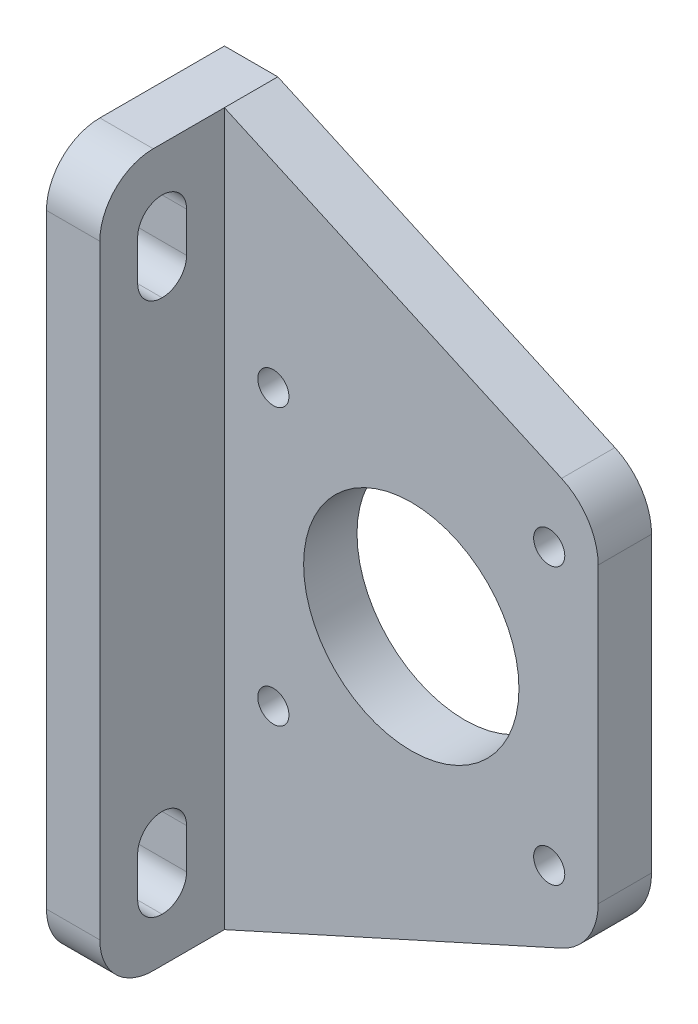
ISO-10303-21;
HEADER;
FILE_DESCRIPTION(('STEP AP214'),'2;1');
FILE_NAME('part.step','',(''),(''),'','','');
FILE_SCHEMA(('AUTOMOTIVE_DESIGN { 1 0 10303 214 1 1 1 1 }'));
ENDSEC;
DATA;
#1=APPLICATION_CONTEXT('core data for automotive mechanical design processes');
#2=APPLICATION_PROTOCOL_DEFINITION('international standard','automotive_design',2000,#1);
#3=PRODUCT_CONTEXT('',#1,'mechanical');
#4=PRODUCT('Part','Part','',(#3));
#5=PRODUCT_RELATED_PRODUCT_CATEGORY('part','',(#4));
#6=PRODUCT_DEFINITION_FORMATION('','',#4);
#7=PRODUCT_DEFINITION_CONTEXT('part definition',#1,'design');
#8=PRODUCT_DEFINITION('design','',#6,#7);
#9=PRODUCT_DEFINITION_SHAPE('','',#8);
#10=(LENGTH_UNIT() NAMED_UNIT(*) SI_UNIT(.MILLI.,.METRE.));
#11=(NAMED_UNIT(*) PLANE_ANGLE_UNIT() SI_UNIT($,.RADIAN.));
#12=(NAMED_UNIT(*) SI_UNIT($,.STERADIAN.) SOLID_ANGLE_UNIT());
#13=UNCERTAINTY_MEASURE_WITH_UNIT(LENGTH_MEASURE(1.E-05),#10,'distance_accuracy_value','');
#14=(GEOMETRIC_REPRESENTATION_CONTEXT(3) GLOBAL_UNCERTAINTY_ASSIGNED_CONTEXT((#13)) GLOBAL_UNIT_ASSIGNED_CONTEXT((#10,
#11,#12)) REPRESENTATION_CONTEXT('',''));
#15=CARTESIAN_POINT('',(0.,0.,0.));
#16=DIRECTION('',(0.,0.,1.));
#17=DIRECTION('',(1.,0.,0.));
#18=AXIS2_PLACEMENT_3D('',#15,#16,#17);
#19=CARTESIAN_POINT('',(15.5000000000009,-15.5,6.));
#20=DIRECTION('',(0.,0.,-1.));
#21=DIRECTION('',(-1.,0.,0.));
#22=AXIS2_PLACEMENT_3D('',#19,#20,#21);
#23=CYLINDRICAL_SURFACE('',#22,1.75);
#24=CARTESIAN_POINT('',(15.5000000000009,-15.5,6.));
#25=DIRECTION('',(0.,0.,1.));
#26=DIRECTION('',(1.,0.,0.));
#27=AXIS2_PLACEMENT_3D('',#24,#25,#26);
#28=CIRCLE('',#27,1.75);
#29=CARTESIAN_POINT('',(17.2500000000009,-15.5,6.));
#30=VERTEX_POINT('',#29);
#31=EDGE_CURVE('E415',#30,#30,#28,.T.);
#32=ORIENTED_EDGE('',*,*,#31,.T.);
#33=EDGE_LOOP('',(#32));
#34=FACE_BOUND('',#33,.T.);
#35=CARTESIAN_POINT('',(15.5000000000009,-15.5,3.5));
#36=DIRECTION('',(0.,0.,-1.));
#37=DIRECTION('',(-1.,0.,0.));
#38=AXIS2_PLACEMENT_3D('',#35,#36,#37);
#39=CIRCLE('',#38,1.75);
#40=CARTESIAN_POINT('',(13.7500000000009,-15.5,3.5));
#41=VERTEX_POINT('',#40);
#42=EDGE_CURVE('E247',#41,#41,#39,.T.);
#43=ORIENTED_EDGE('',*,*,#42,.T.);
#44=EDGE_LOOP('',(#43));
#45=FACE_BOUND('',#44,.T.);
#46=ADVANCED_FACE('F34',(#34,#45),#23,.F.);
#47=CARTESIAN_POINT('',(-15.4999999999991,-15.5000000000009,6.));
#48=DIRECTION('',(0.,0.,-1.));
#49=DIRECTION('',(-1.,0.,0.));
#50=AXIS2_PLACEMENT_3D('',#47,#48,#49);
#51=CYLINDRICAL_SURFACE('',#50,1.75);
#52=CARTESIAN_POINT('',(-15.4999999999991,-15.5000000000009,6.));
#53=DIRECTION('',(0.,0.,1.));
#54=DIRECTION('',(1.,0.,0.));
#55=AXIS2_PLACEMENT_3D('',#52,#53,#54);
#56=CIRCLE('',#55,1.75);
#57=CARTESIAN_POINT('',(-13.7499999999991,-15.5000000000009,6.));
#58=VERTEX_POINT('',#57);
#59=EDGE_CURVE('E412',#58,#58,#56,.T.);
#60=ORIENTED_EDGE('',*,*,#59,.T.);
#61=EDGE_LOOP('',(#60));
#62=FACE_BOUND('',#61,.T.);
#63=CARTESIAN_POINT('',(-15.4999999999991,-15.5000000000009,3.5));
#64=DIRECTION('',(0.,0.,-1.));
#65=DIRECTION('',(-1.,0.,0.));
#66=AXIS2_PLACEMENT_3D('',#63,#64,#65);
#67=CIRCLE('',#66,1.75);
#68=CARTESIAN_POINT('',(-17.2499999999991,-15.5000000000009,3.5));
#69=VERTEX_POINT('',#68);
#70=EDGE_CURVE('E243',#69,#69,#67,.T.);
#71=ORIENTED_EDGE('',*,*,#70,.T.);
#72=EDGE_LOOP('',(#71));
#73=FACE_BOUND('',#72,.T.);
#74=ADVANCED_FACE('F463',(#62,#73),#51,.F.);
#75=CARTESIAN_POINT('',(-15.5,15.4999999999991,6.));
#76=DIRECTION('',(0.,0.,-1.));
#77=DIRECTION('',(-1.,0.,0.));
#78=AXIS2_PLACEMENT_3D('',#75,#76,#77);
#79=CYLINDRICAL_SURFACE('',#78,1.75);
#80=CARTESIAN_POINT('',(-15.5,15.4999999999991,6.));
#81=DIRECTION('',(0.,0.,1.));
#82=DIRECTION('',(1.,0.,0.));
#83=AXIS2_PLACEMENT_3D('',#80,#81,#82);
#84=CIRCLE('',#83,1.75);
#85=CARTESIAN_POINT('',(-13.75,15.4999999999991,6.));
#86=VERTEX_POINT('',#85);
#87=EDGE_CURVE('E238',#86,#86,#84,.T.);
#88=ORIENTED_EDGE('',*,*,#87,.T.);
#89=EDGE_LOOP('',(#88));
#90=FACE_BOUND('',#89,.T.);
#91=CARTESIAN_POINT('',(-15.5,15.4999999999991,3.5));
#92=DIRECTION('',(0.,0.,-1.));
#93=DIRECTION('',(-1.,0.,0.));
#94=AXIS2_PLACEMENT_3D('',#91,#92,#93);
#95=CIRCLE('',#94,1.75);
#96=CARTESIAN_POINT('',(-17.25,15.4999999999991,3.5));
#97=VERTEX_POINT('',#96);
#98=EDGE_CURVE('E240',#97,#97,#95,.T.);
#99=ORIENTED_EDGE('',*,*,#98,.T.);
#100=EDGE_LOOP('',(#99));
#101=FACE_BOUND('',#100,.T.);
#102=ADVANCED_FACE('F469',(#90,#101),#79,.F.);
#103=CARTESIAN_POINT('',(15.5,15.5,6.));
#104=DIRECTION('',(0.,0.,-1.));
#105=DIRECTION('',(-1.,0.,0.));
#106=AXIS2_PLACEMENT_3D('',#103,#104,#105);
#107=CYLINDRICAL_SURFACE('',#106,1.75);
#108=CARTESIAN_POINT('',(15.5,15.5,6.));
#109=DIRECTION('',(0.,0.,1.));
#110=DIRECTION('',(1.,0.,0.));
#111=AXIS2_PLACEMENT_3D('',#108,#109,#110);
#112=CIRCLE('',#111,1.75);
#113=CARTESIAN_POINT('',(17.25,15.5,6.));
#114=VERTEX_POINT('',#113);
#115=EDGE_CURVE('E418',#114,#114,#112,.T.);
#116=ORIENTED_EDGE('',*,*,#115,.T.);
#117=EDGE_LOOP('',(#116));
#118=FACE_BOUND('',#117,.T.);
#119=CARTESIAN_POINT('',(15.5,15.5,3.5));
#120=DIRECTION('',(0.,0.,-1.));
#121=DIRECTION('',(-1.,0.,0.));
#122=AXIS2_PLACEMENT_3D('',#119,#120,#121);
#123=CIRCLE('',#122,1.75);
#124=CARTESIAN_POINT('',(13.75,15.5,3.5));
#125=VERTEX_POINT('',#124);
#126=EDGE_CURVE('E235',#125,#125,#123,.T.);
#127=ORIENTED_EDGE('',*,*,#126,.T.);
#128=EDGE_LOOP('',(#127));
#129=FACE_BOUND('',#128,.T.);
#130=ADVANCED_FACE('F475',(#118,#129),#107,.F.);
#131=CARTESIAN_POINT('',(0.,0.,6.));
#132=DIRECTION('',(0.,0.,1.));
#133=DIRECTION('',(1.,0.,0.));
#134=AXIS2_PLACEMENT_3D('',#131,#132,#133);
#135=PLANE('',#134);
#136=ORIENTED_EDGE('',*,*,#59,.F.);
#137=EDGE_LOOP('',(#136));
#138=FACE_BOUND('',#137,.T.);
#139=ORIENTED_EDGE('',*,*,#115,.F.);
#140=EDGE_LOOP('',(#139));
#141=FACE_BOUND('',#140,.T.);
#142=DIRECTION('',(0.,1.,0.));
#143=VECTOR('',#142,1.);
#144=CARTESIAN_POINT('',(21.,-21.,6.));
#145=LINE('',#144,#143);
#146=CARTESIAN_POINT('',(21.,-16.4837129522559,6.));
#147=VERTEX_POINT('',#146);
#148=CARTESIAN_POINT('',(21.,16.4837129522559,6.));
#149=VERTEX_POINT('',#148);
#150=EDGE_CURVE('E215',#147,#149,#145,.T.);
#151=ORIENTED_EDGE('',*,*,#150,.T.);
#152=CARTESIAN_POINT('',(14.,16.4837129522559,6.));
#153=DIRECTION('',(0.,0.,1.));
#154=DIRECTION('',(1.,0.,0.));
#155=AXIS2_PLACEMENT_3D('',#152,#153,#154);
#156=CIRCLE('',#155,7.);
#157=CARTESIAN_POINT('',(16.8851750889881,22.8614684121244,6.));
#158=VERTEX_POINT('',#157);
#159=EDGE_CURVE('E263',#149,#158,#156,.T.);
#160=ORIENTED_EDGE('',*,*,#159,.T.);
#161=DIRECTION('',(-0.911107922838356,0.412167869855447,0.));
#162=VECTOR('',#161,1.);
#163=CARTESIAN_POINT('',(-21.,40.,6.));
#164=LINE('',#163,#162);
#165=CARTESIAN_POINT('',(-21.,40.,6.));
#166=VERTEX_POINT('',#165);
#167=EDGE_CURVE('E226',#158,#166,#164,.T.);
#168=ORIENTED_EDGE('',*,*,#167,.T.);
#169=DIRECTION('',(0.,-1.,0.));
#170=VECTOR('',#169,1.);
#171=CARTESIAN_POINT('',(-21.,40.,6.));
#172=LINE('',#171,#170);
#173=CARTESIAN_POINT('',(-21.,-40.,6.));
#174=VERTEX_POINT('',#173);
#175=EDGE_CURVE('E428',#166,#174,#172,.T.);
#176=ORIENTED_EDGE('',*,*,#175,.T.);
#177=DIRECTION('',(0.911107922838356,0.412167869855447,0.));
#178=VECTOR('',#177,1.);
#179=CARTESIAN_POINT('',(-21.,-40.,6.));
#180=LINE('',#179,#178);
#181=CARTESIAN_POINT('',(16.8851750889881,-22.8614684121244,6.));
#182=VERTEX_POINT('',#181);
#183=EDGE_CURVE('E213',#174,#182,#180,.T.);
#184=ORIENTED_EDGE('',*,*,#183,.T.);
#185=CARTESIAN_POINT('',(14.,-16.4837129522559,6.));
#186=DIRECTION('',(0.,0.,1.));
#187=DIRECTION('',(1.,0.,0.));
#188=AXIS2_PLACEMENT_3D('',#185,#186,#187);
#189=CIRCLE('',#188,7.);
#190=EDGE_CURVE('E261',#182,#147,#189,.T.);
#191=ORIENTED_EDGE('',*,*,#190,.T.);
#192=EDGE_LOOP('',(#151,#160,#168,#176,#184,#191));
#193=FACE_BOUND('',#192,.T.);
#194=CARTESIAN_POINT('',(0.,0.,6.));
#195=DIRECTION('',(0.,0.,1.));
#196=DIRECTION('',(1.,0.,0.));
#197=AXIS2_PLACEMENT_3D('',#194,#195,#196);
#198=CIRCLE('',#197,12.1);
#199=CARTESIAN_POINT('',(12.1,0.,6.));
#200=VERTEX_POINT('',#199);
#201=EDGE_CURVE('E229',#200,#200,#198,.T.);
#202=ORIENTED_EDGE('',*,*,#201,.F.);
#203=EDGE_LOOP('',(#202));
#204=FACE_BOUND('',#203,.T.);
#205=ORIENTED_EDGE('',*,*,#31,.F.);
#206=EDGE_LOOP('',(#205));
#207=FACE_BOUND('',#206,.T.);
#208=ORIENTED_EDGE('',*,*,#87,.F.);
#209=EDGE_LOOP('',(#208));
#210=FACE_BOUND('',#209,.T.);
#211=ADVANCED_FACE('F434',(#138,#141,#193,#204,#207,#210),#135,.T.);
#212=CARTESIAN_POINT('',(0.,0.,0.));
#213=DIRECTION('',(0.,0.,1.));
#214=DIRECTION('',(1.,0.,0.));
#215=AXIS2_PLACEMENT_3D('',#212,#213,#214);
#216=PLANE('',#215);
#217=CARTESIAN_POINT('',(-15.5,15.5000000000009,0.));
#218=DIRECTION('',(0.,0.,-1.));
#219=DIRECTION('',(-1.,0.,0.));
#220=AXIS2_PLACEMENT_3D('',#217,#218,#219);
#221=CIRCLE('',#220,3.25);
#222=CARTESIAN_POINT('',(-18.75,15.5000000000009,0.));
#223=VERTEX_POINT('',#222);
#224=EDGE_CURVE('E392',#223,#223,#221,.T.);
#225=ORIENTED_EDGE('',*,*,#224,.F.);
#226=EDGE_LOOP('',(#225));
#227=FACE_BOUND('',#226,.T.);
#228=CARTESIAN_POINT('',(-15.5000000000009,-15.4999999999991,0.));
#229=DIRECTION('',(0.,0.,-1.));
#230=DIRECTION('',(-1.,0.,0.));
#231=AXIS2_PLACEMENT_3D('',#228,#229,#230);
#232=CIRCLE('',#231,3.25);
#233=CARTESIAN_POINT('',(-18.7500000000009,-15.4999999999991,0.));
#234=VERTEX_POINT('',#233);
#235=EDGE_CURVE('E398',#234,#234,#232,.T.);
#236=ORIENTED_EDGE('',*,*,#235,.F.);
#237=EDGE_LOOP('',(#236));
#238=FACE_BOUND('',#237,.T.);
#239=CARTESIAN_POINT('',(15.4999999999991,-15.5,0.));
#240=DIRECTION('',(0.,0.,-1.));
#241=DIRECTION('',(-1.,0.,0.));
#242=AXIS2_PLACEMENT_3D('',#239,#240,#241);
#243=CIRCLE('',#242,3.25);
#244=CARTESIAN_POINT('',(12.2499999999991,-15.5,0.));
#245=VERTEX_POINT('',#244);
#246=EDGE_CURVE('E386',#245,#245,#243,.T.);
#247=ORIENTED_EDGE('',*,*,#246,.F.);
#248=EDGE_LOOP('',(#247));
#249=FACE_BOUND('',#248,.T.);
#250=CARTESIAN_POINT('',(15.5,15.5,0.));
#251=DIRECTION('',(0.,0.,-1.));
#252=DIRECTION('',(-1.,0.,0.));
#253=AXIS2_PLACEMENT_3D('',#250,#251,#252);
#254=CIRCLE('',#253,3.25);
#255=CARTESIAN_POINT('',(12.25,15.5,0.));
#256=VERTEX_POINT('',#255);
#257=EDGE_CURVE('E250',#256,#256,#254,.T.);
#258=ORIENTED_EDGE('',*,*,#257,.F.);
#259=EDGE_LOOP('',(#258));
#260=FACE_BOUND('',#259,.T.);
#261=DIRECTION('',(-0.911107922838356,0.412167869855447,0.));
#262=VECTOR('',#261,1.);
#263=CARTESIAN_POINT('',(-21.,40.,0.));
#264=LINE('',#263,#262);
#265=CARTESIAN_POINT('',(16.8851750889881,22.8614684121244,0.));
#266=VERTEX_POINT('',#265);
#267=CARTESIAN_POINT('',(-21.,40.,0.));
#268=VERTEX_POINT('',#267);
#269=EDGE_CURVE('E223',#266,#268,#264,.T.);
#270=ORIENTED_EDGE('',*,*,#269,.F.);
#271=CARTESIAN_POINT('',(14.,16.4837129522559,0.));
#272=DIRECTION('',(0.,0.,1.));
#273=DIRECTION('',(1.,0.,0.));
#274=AXIS2_PLACEMENT_3D('',#271,#272,#273);
#275=CIRCLE('',#274,7.);
#276=CARTESIAN_POINT('',(21.,16.4837129522559,0.));
#277=VERTEX_POINT('',#276);
#278=EDGE_CURVE('E254',#266,#277,#275,.F.);
#279=ORIENTED_EDGE('',*,*,#278,.T.);
#280=DIRECTION('',(0.,1.,0.));
#281=VECTOR('',#280,1.);
#282=CARTESIAN_POINT('',(21.,-21.,0.));
#283=LINE('',#282,#281);
#284=CARTESIAN_POINT('',(21.,-16.4837129522559,0.));
#285=VERTEX_POINT('',#284);
#286=EDGE_CURVE('E222',#285,#277,#283,.T.);
#287=ORIENTED_EDGE('',*,*,#286,.F.);
#288=CARTESIAN_POINT('',(14.,-16.4837129522559,0.));
#289=DIRECTION('',(0.,0.,1.));
#290=DIRECTION('',(1.,0.,0.));
#291=AXIS2_PLACEMENT_3D('',#288,#289,#290);
#292=CIRCLE('',#291,7.);
#293=CARTESIAN_POINT('',(16.8851750889881,-22.8614684121244,0.));
#294=VERTEX_POINT('',#293);
#295=EDGE_CURVE('E221',#285,#294,#292,.F.);
#296=ORIENTED_EDGE('',*,*,#295,.T.);
#297=DIRECTION('',(0.911107922838356,0.412167869855447,0.));
#298=VECTOR('',#297,1.);
#299=CARTESIAN_POINT('',(-21.,-40.,0.));
#300=LINE('',#299,#298);
#301=CARTESIAN_POINT('',(-21.,-40.,0.));
#302=VERTEX_POINT('',#301);
#303=EDGE_CURVE('E210',#302,#294,#300,.T.);
#304=ORIENTED_EDGE('',*,*,#303,.F.);
#305=DIRECTION('',(-1.,0.,0.));
#306=VECTOR('',#305,1.);
#307=CARTESIAN_POINT('',(-21.,-40.,0.));
#308=LINE('',#307,#306);
#309=CARTESIAN_POINT('',(-27.,-40.,0.));
#310=VERTEX_POINT('',#309);
#311=EDGE_CURVE('E191',#302,#310,#308,.T.);
#312=ORIENTED_EDGE('',*,*,#311,.T.);
#313=DIRECTION('',(0.,1.,0.));
#314=VECTOR('',#313,1.);
#315=CARTESIAN_POINT('',(-27.,40.,0.));
#316=LINE('',#315,#314);
#317=CARTESIAN_POINT('',(-27.,40.,0.));
#318=VERTEX_POINT('',#317);
#319=EDGE_CURVE('E203',#310,#318,#316,.T.);
#320=ORIENTED_EDGE('',*,*,#319,.T.);
#321=DIRECTION('',(1.,0.,0.));
#322=VECTOR('',#321,1.);
#323=CARTESIAN_POINT('',(-21.,40.,0.));
#324=LINE('',#323,#322);
#325=EDGE_CURVE('E367',#318,#268,#324,.T.);
#326=ORIENTED_EDGE('',*,*,#325,.T.);
#327=EDGE_LOOP('',(#270,#279,#287,#296,#304,#312,#320,#326));
#328=FACE_BOUND('',#327,.T.);
#329=CARTESIAN_POINT('',(0.,0.,0.));
#330=DIRECTION('',(0.,0.,1.));
#331=DIRECTION('',(1.,0.,0.));
#332=AXIS2_PLACEMENT_3D('',#329,#330,#331);
#333=CIRCLE('',#332,12.1);
#334=CARTESIAN_POINT('',(12.1,0.,0.));
#335=VERTEX_POINT('',#334);
#336=EDGE_CURVE('E421',#335,#335,#333,.T.);
#337=ORIENTED_EDGE('',*,*,#336,.T.);
#338=EDGE_LOOP('',(#337));
#339=FACE_BOUND('',#338,.T.);
#340=ADVANCED_FACE('F218',(#227,#238,#249,#260,#328,#339),#216,.F.);
#341=CARTESIAN_POINT('',(-21.,40.,6.));
#342=DIRECTION('',(-0.412167869855447,-0.911107922838356,0.));
#343=DIRECTION('',(0.911107922838356,-0.412167869855447,0.));
#344=AXIS2_PLACEMENT_3D('',#341,#342,#343);
#345=PLANE('',#344);
#346=ORIENTED_EDGE('',*,*,#167,.F.);
#347=DIRECTION('',(0.,0.,-1.));
#348=VECTOR('',#347,1.);
#349=CARTESIAN_POINT('',(16.8851750889881,22.8614684121244,6.));
#350=LINE('',#349,#348);
#351=EDGE_CURVE('E234',#158,#266,#350,.T.);
#352=ORIENTED_EDGE('',*,*,#351,.T.);
#353=ORIENTED_EDGE('',*,*,#269,.T.);
#354=DIRECTION('',(0.,0.,-1.));
#355=VECTOR('',#354,1.);
#356=CARTESIAN_POINT('',(-21.,40.,6.));
#357=LINE('',#356,#355);
#358=EDGE_CURVE('E214',#166,#268,#357,.T.);
#359=ORIENTED_EDGE('',*,*,#358,.F.);
#360=EDGE_LOOP('',(#346,#352,#353,#359));
#361=FACE_BOUND('',#360,.T.);
#362=ADVANCED_FACE('F445',(#361),#345,.F.);
#363=CARTESIAN_POINT('',(-21.,-40.,6.));
#364=DIRECTION('',(-0.412167869855447,0.911107922838356,0.));
#365=DIRECTION('',(-0.911107922838356,-0.412167869855447,0.));
#366=AXIS2_PLACEMENT_3D('',#363,#364,#365);
#367=PLANE('',#366);
#368=ORIENTED_EDGE('',*,*,#303,.T.);
#369=DIRECTION('',(0.,0.,-1.));
#370=VECTOR('',#369,1.);
#371=CARTESIAN_POINT('',(16.8851750889881,-22.8614684121244,6.));
#372=LINE('',#371,#370);
#373=EDGE_CURVE('E265',#294,#182,#372,.F.);
#374=ORIENTED_EDGE('',*,*,#373,.T.);
#375=ORIENTED_EDGE('',*,*,#183,.F.);
#376=DIRECTION('',(0.,0.,-1.));
#377=VECTOR('',#376,1.);
#378=CARTESIAN_POINT('',(-21.,-40.,6.));
#379=LINE('',#378,#377);
#380=EDGE_CURVE('E195',#174,#302,#379,.T.);
#381=ORIENTED_EDGE('',*,*,#380,.T.);
#382=EDGE_LOOP('',(#368,#374,#375,#381));
#383=FACE_BOUND('',#382,.T.);
#384=ADVANCED_FACE('F209',(#383),#367,.F.);
#385=CARTESIAN_POINT('',(21.,-21.,6.));
#386=DIRECTION('',(-1.,0.,0.));
#387=DIRECTION('',(0.,0.,1.));
#388=AXIS2_PLACEMENT_3D('',#385,#386,#387);
#389=PLANE('',#388);
#390=ORIENTED_EDGE('',*,*,#286,.T.);
#391=DIRECTION('',(0.,0.,-1.));
#392=VECTOR('',#391,1.);
#393=CARTESIAN_POINT('',(21.,16.4837129522559,6.));
#394=LINE('',#393,#392);
#395=EDGE_CURVE('E259',#277,#149,#394,.F.);
#396=ORIENTED_EDGE('',*,*,#395,.T.);
#397=ORIENTED_EDGE('',*,*,#150,.F.);
#398=DIRECTION('',(0.,0.,-1.));
#399=VECTOR('',#398,1.);
#400=CARTESIAN_POINT('',(21.,-16.4837129522559,6.));
#401=LINE('',#400,#399);
#402=EDGE_CURVE('E256',#147,#285,#401,.T.);
#403=ORIENTED_EDGE('',*,*,#402,.T.);
#404=EDGE_LOOP('',(#390,#396,#397,#403));
#405=FACE_BOUND('',#404,.T.);
#406=ADVANCED_FACE('F449',(#405),#389,.F.);
#407=CARTESIAN_POINT('',(0.,0.,6.));
#408=DIRECTION('',(0.,0.,-1.));
#409=DIRECTION('',(-1.,0.,0.));
#410=AXIS2_PLACEMENT_3D('',#407,#408,#409);
#411=CYLINDRICAL_SURFACE('',#410,12.1);
#412=ORIENTED_EDGE('',*,*,#201,.T.);
#413=EDGE_LOOP('',(#412));
#414=FACE_BOUND('',#413,.T.);
#415=ORIENTED_EDGE('',*,*,#336,.F.);
#416=EDGE_LOOP('',(#415));
#417=FACE_BOUND('',#416,.T.);
#418=ADVANCED_FACE('F451',(#414,#417),#411,.F.);
#419=CARTESIAN_POINT('',(15.5,15.5,3.5));
#420=DIRECTION('',(0.,0.,-1.));
#421=DIRECTION('',(-1.,0.,0.));
#422=AXIS2_PLACEMENT_3D('',#419,#420,#421);
#423=CYLINDRICAL_SURFACE('',#422,3.25);
#424=CARTESIAN_POINT('',(15.5,15.5,3.5));
#425=DIRECTION('',(0.,0.,-1.));
#426=DIRECTION('',(-1.,0.,0.));
#427=AXIS2_PLACEMENT_3D('',#424,#425,#426);
#428=CIRCLE('',#427,3.25);
#429=CARTESIAN_POINT('',(12.25,15.5,3.5));
#430=VERTEX_POINT('',#429);
#431=EDGE_CURVE('E239',#430,#430,#428,.T.);
#432=ORIENTED_EDGE('',*,*,#431,.F.);
#433=EDGE_LOOP('',(#432));
#434=FACE_BOUND('',#433,.T.);
#435=ORIENTED_EDGE('',*,*,#257,.T.);
#436=EDGE_LOOP('',(#435));
#437=FACE_BOUND('',#436,.T.);
#438=ADVANCED_FACE('F457',(#434,#437),#423,.F.);
#439=CARTESIAN_POINT('',(15.5,15.5,3.5));
#440=DIRECTION('',(0.,0.,-1.));
#441=DIRECTION('',(-1.,0.,0.));
#442=AXIS2_PLACEMENT_3D('',#439,#440,#441);
#443=PLANE('',#442);
#444=ORIENTED_EDGE('',*,*,#126,.F.);
#445=EDGE_LOOP('',(#444));
#446=FACE_BOUND('',#445,.T.);
#447=ORIENTED_EDGE('',*,*,#431,.T.);
#448=EDGE_LOOP('',(#447));
#449=FACE_BOUND('',#448,.T.);
#450=ADVANCED_FACE('F496',(#446,#449),#443,.T.);
#451=CARTESIAN_POINT('',(-15.5,15.5000000000009,3.5));
#452=DIRECTION('',(0.,0.,-1.));
#453=DIRECTION('',(-1.,0.,0.));
#454=AXIS2_PLACEMENT_3D('',#451,#452,#453);
#455=CYLINDRICAL_SURFACE('',#454,3.25);
#456=CARTESIAN_POINT('',(-15.5,15.5000000000009,3.5));
#457=DIRECTION('',(0.,0.,-1.));
#458=DIRECTION('',(-1.,0.,0.));
#459=AXIS2_PLACEMENT_3D('',#456,#457,#458);
#460=CIRCLE('',#459,3.25);
#461=CARTESIAN_POINT('',(-18.75,15.5000000000009,3.5));
#462=VERTEX_POINT('',#461);
#463=EDGE_CURVE('E244',#462,#462,#460,.T.);
#464=ORIENTED_EDGE('',*,*,#463,.F.);
#465=EDGE_LOOP('',(#464));
#466=FACE_BOUND('',#465,.T.);
#467=ORIENTED_EDGE('',*,*,#224,.T.);
#468=EDGE_LOOP('',(#467));
#469=FACE_BOUND('',#468,.T.);
#470=ADVANCED_FACE('F502',(#466,#469),#455,.F.);
#471=CARTESIAN_POINT('',(-15.5,15.5000000000009,3.5));
#472=DIRECTION('',(0.,0.,-1.));
#473=DIRECTION('',(-1.,0.,0.));
#474=AXIS2_PLACEMENT_3D('',#471,#472,#473);
#475=PLANE('',#474);
#476=ORIENTED_EDGE('',*,*,#98,.F.);
#477=EDGE_LOOP('',(#476));
#478=FACE_BOUND('',#477,.T.);
#479=ORIENTED_EDGE('',*,*,#463,.T.);
#480=EDGE_LOOP('',(#479));
#481=FACE_BOUND('',#480,.T.);
#482=ADVANCED_FACE('F515',(#478,#481),#475,.T.);
#483=CARTESIAN_POINT('',(-15.5000000000009,-15.4999999999991,3.5));
#484=DIRECTION('',(0.,0.,-1.));
#485=DIRECTION('',(-1.,0.,0.));
#486=AXIS2_PLACEMENT_3D('',#483,#484,#485);
#487=CYLINDRICAL_SURFACE('',#486,3.25);
#488=CARTESIAN_POINT('',(-15.5000000000009,-15.4999999999991,3.5));
#489=DIRECTION('',(0.,0.,-1.));
#490=DIRECTION('',(-1.,0.,0.));
#491=AXIS2_PLACEMENT_3D('',#488,#489,#490);
#492=CIRCLE('',#491,3.25);
#493=CARTESIAN_POINT('',(-18.7500000000009,-15.4999999999991,3.5));
#494=VERTEX_POINT('',#493);
#495=EDGE_CURVE('E395',#494,#494,#492,.T.);
#496=ORIENTED_EDGE('',*,*,#495,.F.);
#497=EDGE_LOOP('',(#496));
#498=FACE_BOUND('',#497,.T.);
#499=ORIENTED_EDGE('',*,*,#235,.T.);
#500=EDGE_LOOP('',(#499));
#501=FACE_BOUND('',#500,.T.);
#502=ADVANCED_FACE('F518',(#498,#501),#487,.F.);
#503=CARTESIAN_POINT('',(-15.5000000000009,-15.4999999999991,3.5));
#504=DIRECTION('',(0.,0.,-1.));
#505=DIRECTION('',(-1.,0.,0.));
#506=AXIS2_PLACEMENT_3D('',#503,#504,#505);
#507=PLANE('',#506);
#508=ORIENTED_EDGE('',*,*,#70,.F.);
#509=EDGE_LOOP('',(#508));
#510=FACE_BOUND('',#509,.T.);
#511=ORIENTED_EDGE('',*,*,#495,.T.);
#512=EDGE_LOOP('',(#511));
#513=FACE_BOUND('',#512,.T.);
#514=ADVANCED_FACE('F529',(#510,#513),#507,.T.);
#515=CARTESIAN_POINT('',(15.4999999999991,-15.5,3.5));
#516=DIRECTION('',(0.,0.,-1.));
#517=DIRECTION('',(-1.,0.,0.));
#518=AXIS2_PLACEMENT_3D('',#515,#516,#517);
#519=CYLINDRICAL_SURFACE('',#518,3.25);
#520=CARTESIAN_POINT('',(15.4999999999991,-15.5,3.5));
#521=DIRECTION('',(0.,0.,-1.));
#522=DIRECTION('',(-1.,0.,0.));
#523=AXIS2_PLACEMENT_3D('',#520,#521,#522);
#524=CIRCLE('',#523,3.25);
#525=CARTESIAN_POINT('',(12.2499999999991,-15.5,3.5));
#526=VERTEX_POINT('',#525);
#527=EDGE_CURVE('E401',#526,#526,#524,.T.);
#528=ORIENTED_EDGE('',*,*,#527,.F.);
#529=EDGE_LOOP('',(#528));
#530=FACE_BOUND('',#529,.T.);
#531=ORIENTED_EDGE('',*,*,#246,.T.);
#532=EDGE_LOOP('',(#531));
#533=FACE_BOUND('',#532,.T.);
#534=ADVANCED_FACE('F532',(#530,#533),#519,.F.);
#535=CARTESIAN_POINT('',(15.4999999999991,-15.5,3.5));
#536=DIRECTION('',(0.,0.,-1.));
#537=DIRECTION('',(-1.,0.,0.));
#538=AXIS2_PLACEMENT_3D('',#535,#536,#537);
#539=PLANE('',#538);
#540=ORIENTED_EDGE('',*,*,#42,.F.);
#541=EDGE_LOOP('',(#540));
#542=FACE_BOUND('',#541,.T.);
#543=ORIENTED_EDGE('',*,*,#527,.T.);
#544=EDGE_LOOP('',(#543));
#545=FACE_BOUND('',#544,.T.);
#546=ADVANCED_FACE('F537',(#542,#545),#539,.T.);
#547=CARTESIAN_POINT('',(14.,16.4837129522559,6.));
#548=DIRECTION('',(0.,0.,-1.));
#549=DIRECTION('',(-1.,0.,0.));
#550=AXIS2_PLACEMENT_3D('',#547,#548,#549);
#551=CYLINDRICAL_SURFACE('',#550,7.);
#552=ORIENTED_EDGE('',*,*,#159,.F.);
#553=ORIENTED_EDGE('',*,*,#395,.F.);
#554=ORIENTED_EDGE('',*,*,#278,.F.);
#555=ORIENTED_EDGE('',*,*,#351,.F.);
#556=EDGE_LOOP('',(#552,#553,#554,#555));
#557=FACE_BOUND('',#556,.T.);
#558=ADVANCED_FACE('F443',(#557),#551,.T.);
#559=CARTESIAN_POINT('',(14.,-16.4837129522559,6.));
#560=DIRECTION('',(0.,0.,-1.));
#561=DIRECTION('',(-1.,0.,0.));
#562=AXIS2_PLACEMENT_3D('',#559,#560,#561);
#563=CYLINDRICAL_SURFACE('',#562,7.);
#564=ORIENTED_EDGE('',*,*,#190,.F.);
#565=ORIENTED_EDGE('',*,*,#373,.F.);
#566=ORIENTED_EDGE('',*,*,#295,.F.);
#567=ORIENTED_EDGE('',*,*,#402,.F.);
#568=EDGE_LOOP('',(#564,#565,#566,#567));
#569=FACE_BOUND('',#568,.T.);
#570=ADVANCED_FACE('F448',(#569),#563,.T.);
#571=CARTESIAN_POINT('',(-21.,40.,20.));
#572=DIRECTION('',(1.,0.,0.));
#573=DIRECTION('',(0.,0.,-1.));
#574=AXIS2_PLACEMENT_3D('',#571,#572,#573);
#575=PLANE('',#574);
#576=CARTESIAN_POINT('',(-21.,32.25,13.));
#577=DIRECTION('',(1.,0.,0.));
#578=DIRECTION('',(0.,0.,-1.));
#579=AXIS2_PLACEMENT_3D('',#576,#577,#578);
#580=CIRCLE('',#579,2.75);
#581=CARTESIAN_POINT('',(-21.,32.25,15.75));
#582=VERTEX_POINT('',#581);
#583=CARTESIAN_POINT('',(-21.,35.,13.));
#584=VERTEX_POINT('',#583);
#585=EDGE_CURVE('E299',#582,#584,#580,.F.);
#586=ORIENTED_EDGE('',*,*,#585,.T.);
#587=CARTESIAN_POINT('',(-21.,32.25,13.));
#588=DIRECTION('',(1.,0.,0.));
#589=DIRECTION('',(0.,0.,-1.));
#590=AXIS2_PLACEMENT_3D('',#587,#588,#589);
#591=CIRCLE('',#590,2.75);
#592=CARTESIAN_POINT('',(-21.,32.25,10.25));
#593=VERTEX_POINT('',#592);
#594=EDGE_CURVE('E311',#584,#593,#591,.F.);
#595=ORIENTED_EDGE('',*,*,#594,.T.);
#596=DIRECTION('',(0.,1.,0.));
#597=VECTOR('',#596,1.);
#598=CARTESIAN_POINT('',(-21.,25.,10.25));
#599=LINE('',#598,#597);
#600=CARTESIAN_POINT('',(-21.,27.75,10.25));
#601=VERTEX_POINT('',#600);
#602=EDGE_CURVE('E853',#601,#593,#599,.T.);
#603=ORIENTED_EDGE('',*,*,#602,.F.);
#604=CARTESIAN_POINT('',(-21.,27.75,13.));
#605=DIRECTION('',(1.,0.,0.));
#606=DIRECTION('',(0.,0.,-1.));
#607=AXIS2_PLACEMENT_3D('',#604,#605,#606);
#608=CIRCLE('',#607,2.75);
#609=CARTESIAN_POINT('',(-21.,25.,13.));
#610=VERTEX_POINT('',#609);
#611=EDGE_CURVE('E307',#601,#610,#608,.F.);
#612=ORIENTED_EDGE('',*,*,#611,.T.);
#613=CARTESIAN_POINT('',(-21.,27.75,13.));
#614=DIRECTION('',(1.,0.,0.));
#615=DIRECTION('',(0.,0.,-1.));
#616=AXIS2_PLACEMENT_3D('',#613,#614,#615);
#617=CIRCLE('',#616,2.75);
#618=CARTESIAN_POINT('',(-21.,27.75,15.75));
#619=VERTEX_POINT('',#618);
#620=EDGE_CURVE('E303',#610,#619,#617,.F.);
#621=ORIENTED_EDGE('',*,*,#620,.T.);
#622=DIRECTION('',(0.,-1.,0.));
#623=VECTOR('',#622,1.);
#624=CARTESIAN_POINT('',(-21.,25.,15.75));
#625=LINE('',#624,#623);
#626=EDGE_CURVE('E335',#582,#619,#625,.T.);
#627=ORIENTED_EDGE('',*,*,#626,.F.);
#628=EDGE_LOOP('',(#586,#595,#603,#612,#621,#627));
#629=FACE_BOUND('',#628,.T.);
#630=DIRECTION('',(0.,1.,0.));
#631=VECTOR('',#630,1.);
#632=CARTESIAN_POINT('',(-21.,-25.,10.25));
#633=LINE('',#632,#631);
#634=CARTESIAN_POINT('',(-21.,-32.25,10.25));
#635=VERTEX_POINT('',#634);
#636=CARTESIAN_POINT('',(-21.,-27.75,10.25));
#637=VERTEX_POINT('',#636);
#638=EDGE_CURVE('E851',#635,#637,#633,.T.);
#639=ORIENTED_EDGE('',*,*,#638,.F.);
#640=CARTESIAN_POINT('',(-21.,-32.25,13.));
#641=DIRECTION('',(1.,0.,0.));
#642=DIRECTION('',(0.,0.,-1.));
#643=AXIS2_PLACEMENT_3D('',#640,#641,#642);
#644=CIRCLE('',#643,2.75);
#645=CARTESIAN_POINT('',(-21.,-35.,13.));
#646=VERTEX_POINT('',#645);
#647=EDGE_CURVE('E327',#635,#646,#644,.F.);
#648=ORIENTED_EDGE('',*,*,#647,.T.);
#649=CARTESIAN_POINT('',(-21.,-32.25,13.));
#650=DIRECTION('',(1.,0.,0.));
#651=DIRECTION('',(0.,0.,-1.));
#652=AXIS2_PLACEMENT_3D('',#649,#650,#651);
#653=CIRCLE('',#652,2.75);
#654=CARTESIAN_POINT('',(-21.,-32.25,15.75));
#655=VERTEX_POINT('',#654);
#656=EDGE_CURVE('E323',#646,#655,#653,.F.);
#657=ORIENTED_EDGE('',*,*,#656,.T.);
#658=DIRECTION('',(0.,-1.,0.));
#659=VECTOR('',#658,1.);
#660=CARTESIAN_POINT('',(-21.,-25.,15.75));
#661=LINE('',#660,#659);
#662=CARTESIAN_POINT('',(-21.,-27.75,15.75));
#663=VERTEX_POINT('',#662);
#664=EDGE_CURVE('E204',#663,#655,#661,.T.);
#665=ORIENTED_EDGE('',*,*,#664,.F.);
#666=CARTESIAN_POINT('',(-21.,-27.75,13.));
#667=DIRECTION('',(1.,0.,0.));
#668=DIRECTION('',(0.,0.,-1.));
#669=AXIS2_PLACEMENT_3D('',#666,#667,#668);
#670=CIRCLE('',#669,2.75);
#671=CARTESIAN_POINT('',(-21.,-25.,13.));
#672=VERTEX_POINT('',#671);
#673=EDGE_CURVE('E315',#663,#672,#670,.F.);
#674=ORIENTED_EDGE('',*,*,#673,.T.);
#675=CARTESIAN_POINT('',(-21.,-27.75,13.));
#676=DIRECTION('',(1.,0.,0.));
#677=DIRECTION('',(0.,0.,-1.));
#678=AXIS2_PLACEMENT_3D('',#675,#676,#677);
#679=CIRCLE('',#678,2.75);
#680=EDGE_CURVE('E319',#672,#637,#679,.F.);
#681=ORIENTED_EDGE('',*,*,#680,.T.);
#682=EDGE_LOOP('',(#639,#648,#657,#665,#674,#681));
#683=FACE_BOUND('',#682,.T.);
#684=DIRECTION('',(0.,0.,-1.));
#685=VECTOR('',#684,1.);
#686=CARTESIAN_POINT('',(-21.,40.,20.));
#687=LINE('',#686,#685);
#688=CARTESIAN_POINT('',(-21.,40.,14.));
#689=VERTEX_POINT('',#688);
#690=EDGE_CURVE('E368',#689,#166,#687,.T.);
#691=ORIENTED_EDGE('',*,*,#690,.F.);
#692=CARTESIAN_POINT('',(-21.,34.,14.));
#693=DIRECTION('',(1.,0.,0.));
#694=DIRECTION('',(0.,0.,-1.));
#695=AXIS2_PLACEMENT_3D('',#692,#693,#694);
#696=CIRCLE('',#695,6.);
#697=CARTESIAN_POINT('',(-21.,34.,20.));
#698=VERTEX_POINT('',#697);
#699=EDGE_CURVE('E349',#689,#698,#696,.T.);
#700=ORIENTED_EDGE('',*,*,#699,.T.);
#701=DIRECTION('',(0.,-1.,0.));
#702=VECTOR('',#701,1.);
#703=CARTESIAN_POINT('',(-21.,40.,20.));
#704=LINE('',#703,#702);
#705=CARTESIAN_POINT('',(-21.,-34.,20.));
#706=VERTEX_POINT('',#705);
#707=EDGE_CURVE('E374',#698,#706,#704,.T.);
#708=ORIENTED_EDGE('',*,*,#707,.T.);
#709=CARTESIAN_POINT('',(-21.,-34.,14.));
#710=DIRECTION('',(1.,0.,0.));
#711=DIRECTION('',(0.,0.,-1.));
#712=AXIS2_PLACEMENT_3D('',#709,#710,#711);
#713=CIRCLE('',#712,6.);
#714=CARTESIAN_POINT('',(-21.,-40.,14.));
#715=VERTEX_POINT('',#714);
#716=EDGE_CURVE('E347',#706,#715,#713,.T.);
#717=ORIENTED_EDGE('',*,*,#716,.T.);
#718=DIRECTION('',(0.,0.,-1.));
#719=VECTOR('',#718,1.);
#720=CARTESIAN_POINT('',(-21.,-40.,20.));
#721=LINE('',#720,#719);
#722=EDGE_CURVE('E379',#715,#174,#721,.T.);
#723=ORIENTED_EDGE('',*,*,#722,.T.);
#724=ORIENTED_EDGE('',*,*,#175,.F.);
#725=EDGE_LOOP('',(#691,#700,#708,#717,#723,#724));
#726=FACE_BOUND('',#725,.T.);
#727=ADVANCED_FACE('F373',(#629,#683,#726),#575,.T.);
#728=CARTESIAN_POINT('',(-21.,40.,20.));
#729=DIRECTION('',(0.,1.,0.));
#730=DIRECTION('',(0.,0.,1.));
#731=AXIS2_PLACEMENT_3D('',#728,#729,#730);
#732=PLANE('',#731);
#733=DIRECTION('',(0.,0.,-1.));
#734=VECTOR('',#733,1.);
#735=CARTESIAN_POINT('',(-27.,40.,20.));
#736=LINE('',#735,#734);
#737=CARTESIAN_POINT('',(-27.,40.,14.));
#738=VERTEX_POINT('',#737);
#739=EDGE_CURVE('E358',#738,#318,#736,.T.);
#740=ORIENTED_EDGE('',*,*,#739,.F.);
#741=DIRECTION('',(1.,0.,0.));
#742=VECTOR('',#741,1.);
#743=CARTESIAN_POINT('',(-21.,40.,14.));
#744=LINE('',#743,#742);
#745=EDGE_CURVE('E331',#738,#689,#744,.T.);
#746=ORIENTED_EDGE('',*,*,#745,.T.);
#747=ORIENTED_EDGE('',*,*,#690,.T.);
#748=ORIENTED_EDGE('',*,*,#358,.T.);
#749=ORIENTED_EDGE('',*,*,#325,.F.);
#750=EDGE_LOOP('',(#740,#746,#747,#748,#749));
#751=FACE_BOUND('',#750,.T.);
#752=ADVANCED_FACE('F364',(#751),#732,.T.);
#753=CARTESIAN_POINT('',(-27.,40.,20.));
#754=DIRECTION('',(-1.,0.,0.));
#755=DIRECTION('',(0.,-1.,0.));
#756=AXIS2_PLACEMENT_3D('',#753,#754,#755);
#757=PLANE('',#756);
#758=CARTESIAN_POINT('',(-27.,27.75,13.));
#759=DIRECTION('',(-1.,0.,0.));
#760=DIRECTION('',(0.,-1.,0.));
#761=AXIS2_PLACEMENT_3D('',#758,#759,#760);
#762=CIRCLE('',#761,2.75);
#763=CARTESIAN_POINT('',(-27.,27.75,15.75));
#764=VERTEX_POINT('',#763);
#765=CARTESIAN_POINT('',(-27.,25.,13.));
#766=VERTEX_POINT('',#765);
#767=EDGE_CURVE('E305',#764,#766,#762,.F.);
#768=ORIENTED_EDGE('',*,*,#767,.T.);
#769=CARTESIAN_POINT('',(-27.,27.75,13.));
#770=DIRECTION('',(-1.,0.,0.));
#771=DIRECTION('',(0.,-1.,0.));
#772=AXIS2_PLACEMENT_3D('',#769,#770,#771);
#773=CIRCLE('',#772,2.75);
#774=CARTESIAN_POINT('',(-27.,27.75,10.25));
#775=VERTEX_POINT('',#774);
#776=EDGE_CURVE('E309',#766,#775,#773,.F.);
#777=ORIENTED_EDGE('',*,*,#776,.T.);
#778=DIRECTION('',(0.,-1.,0.));
#779=VECTOR('',#778,1.);
#780=CARTESIAN_POINT('',(-27.,40.,10.25));
#781=LINE('',#780,#779);
#782=CARTESIAN_POINT('',(-27.,32.25,10.25));
#783=VERTEX_POINT('',#782);
#784=EDGE_CURVE('E273',#783,#775,#781,.T.);
#785=ORIENTED_EDGE('',*,*,#784,.F.);
#786=CARTESIAN_POINT('',(-27.,32.25,13.));
#787=DIRECTION('',(-1.,0.,0.));
#788=DIRECTION('',(0.,-1.,0.));
#789=AXIS2_PLACEMENT_3D('',#786,#787,#788);
#790=CIRCLE('',#789,2.75);
#791=CARTESIAN_POINT('',(-27.,35.,13.));
#792=VERTEX_POINT('',#791);
#793=EDGE_CURVE('E313',#783,#792,#790,.F.);
#794=ORIENTED_EDGE('',*,*,#793,.T.);
#795=CARTESIAN_POINT('',(-27.,32.25,13.));
#796=DIRECTION('',(-1.,0.,0.));
#797=DIRECTION('',(0.,-1.,0.));
#798=AXIS2_PLACEMENT_3D('',#795,#796,#797);
#799=CIRCLE('',#798,2.75);
#800=CARTESIAN_POINT('',(-27.,32.25,15.75));
#801=VERTEX_POINT('',#800);
#802=EDGE_CURVE('E301',#792,#801,#799,.F.);
#803=ORIENTED_EDGE('',*,*,#802,.T.);
#804=DIRECTION('',(0.,1.,0.));
#805=VECTOR('',#804,1.);
#806=CARTESIAN_POINT('',(-27.,40.,15.75));
#807=LINE('',#806,#805);
#808=EDGE_CURVE('E276',#764,#801,#807,.T.);
#809=ORIENTED_EDGE('',*,*,#808,.F.);
#810=EDGE_LOOP('',(#768,#777,#785,#794,#803,#809));
#811=FACE_BOUND('',#810,.T.);
#812=DIRECTION('',(0.,-1.,0.));
#813=VECTOR('',#812,1.);
#814=CARTESIAN_POINT('',(-27.,40.,10.25));
#815=LINE('',#814,#813);
#816=CARTESIAN_POINT('',(-27.,-27.75,10.25));
#817=VERTEX_POINT('',#816);
#818=CARTESIAN_POINT('',(-27.,-32.25,10.25));
#819=VERTEX_POINT('',#818);
#820=EDGE_CURVE('E270',#817,#819,#815,.T.);
#821=ORIENTED_EDGE('',*,*,#820,.F.);
#822=CARTESIAN_POINT('',(-27.,-27.75,13.));
#823=DIRECTION('',(-1.,0.,0.));
#824=DIRECTION('',(0.,-1.,0.));
#825=AXIS2_PLACEMENT_3D('',#822,#823,#824);
#826=CIRCLE('',#825,2.75);
#827=CARTESIAN_POINT('',(-27.,-25.,13.));
#828=VERTEX_POINT('',#827);
#829=EDGE_CURVE('E321',#817,#828,#826,.F.);
#830=ORIENTED_EDGE('',*,*,#829,.T.);
#831=CARTESIAN_POINT('',(-27.,-27.75,13.));
#832=DIRECTION('',(-1.,0.,0.));
#833=DIRECTION('',(0.,-1.,0.));
#834=AXIS2_PLACEMENT_3D('',#831,#832,#833);
#835=CIRCLE('',#834,2.75);
#836=CARTESIAN_POINT('',(-27.,-27.75,15.75));
#837=VERTEX_POINT('',#836);
#838=EDGE_CURVE('E317',#828,#837,#835,.F.);
#839=ORIENTED_EDGE('',*,*,#838,.T.);
#840=DIRECTION('',(0.,1.,0.));
#841=VECTOR('',#840,1.);
#842=CARTESIAN_POINT('',(-27.,40.,15.75));
#843=LINE('',#842,#841);
#844=CARTESIAN_POINT('',(-27.,-32.25,15.75));
#845=VERTEX_POINT('',#844);
#846=EDGE_CURVE('E267',#845,#837,#843,.T.);
#847=ORIENTED_EDGE('',*,*,#846,.F.);
#848=CARTESIAN_POINT('',(-27.,-32.25,13.));
#849=DIRECTION('',(-1.,0.,0.));
#850=DIRECTION('',(0.,-1.,0.));
#851=AXIS2_PLACEMENT_3D('',#848,#849,#850);
#852=CIRCLE('',#851,2.75);
#853=CARTESIAN_POINT('',(-27.,-35.,13.));
#854=VERTEX_POINT('',#853);
#855=EDGE_CURVE('E325',#845,#854,#852,.F.);
#856=ORIENTED_EDGE('',*,*,#855,.T.);
#857=CARTESIAN_POINT('',(-27.,-32.25,13.));
#858=DIRECTION('',(-1.,0.,0.));
#859=DIRECTION('',(0.,-1.,0.));
#860=AXIS2_PLACEMENT_3D('',#857,#858,#859);
#861=CIRCLE('',#860,2.75);
#862=EDGE_CURVE('E329',#854,#819,#861,.F.);
#863=ORIENTED_EDGE('',*,*,#862,.T.);
#864=EDGE_LOOP('',(#821,#830,#839,#847,#856,#863));
#865=FACE_BOUND('',#864,.T.);
#866=DIRECTION('',(0.,1.,0.));
#867=VECTOR('',#866,1.);
#868=CARTESIAN_POINT('',(-27.,40.,20.));
#869=LINE('',#868,#867);
#870=CARTESIAN_POINT('',(-27.,-34.,20.));
#871=VERTEX_POINT('',#870);
#872=CARTESIAN_POINT('',(-27.,34.,20.));
#873=VERTEX_POINT('',#872);
#874=EDGE_CURVE('E359',#871,#873,#869,.T.);
#875=ORIENTED_EDGE('',*,*,#874,.T.);
#876=CARTESIAN_POINT('',(-27.,34.,14.));
#877=DIRECTION('',(-1.,0.,0.));
#878=DIRECTION('',(0.,-1.,0.));
#879=AXIS2_PLACEMENT_3D('',#876,#877,#878);
#880=CIRCLE('',#879,6.);
#881=EDGE_CURVE('E42',#873,#738,#880,.T.);
#882=ORIENTED_EDGE('',*,*,#881,.T.);
#883=ORIENTED_EDGE('',*,*,#739,.T.);
#884=ORIENTED_EDGE('',*,*,#319,.F.);
#885=DIRECTION('',(0.,0.,-1.));
#886=VECTOR('',#885,1.);
#887=CARTESIAN_POINT('',(-27.,-40.,20.));
#888=LINE('',#887,#886);
#889=CARTESIAN_POINT('',(-27.,-40.,14.));
#890=VERTEX_POINT('',#889);
#891=EDGE_CURVE('E198',#890,#310,#888,.T.);
#892=ORIENTED_EDGE('',*,*,#891,.F.);
#893=CARTESIAN_POINT('',(-27.,-34.,14.));
#894=DIRECTION('',(-1.,0.,0.));
#895=DIRECTION('',(0.,-1.,0.));
#896=AXIS2_PLACEMENT_3D('',#893,#894,#895);
#897=CIRCLE('',#896,6.);
#898=EDGE_CURVE('E49',#890,#871,#897,.T.);
#899=ORIENTED_EDGE('',*,*,#898,.T.);
#900=EDGE_LOOP('',(#875,#882,#883,#884,#892,#899));
#901=FACE_BOUND('',#900,.T.);
#902=ADVANCED_FACE('F357',(#811,#865,#901),#757,.T.);
#903=CARTESIAN_POINT('',(-21.,-40.,20.));
#904=DIRECTION('',(0.,-1.,0.));
#905=DIRECTION('',(0.,0.,-1.));
#906=AXIS2_PLACEMENT_3D('',#903,#904,#905);
#907=PLANE('',#906);
#908=ORIENTED_EDGE('',*,*,#722,.F.);
#909=DIRECTION('',(-1.,0.,0.));
#910=VECTOR('',#909,1.);
#911=CARTESIAN_POINT('',(-27.,-40.,14.));
#912=LINE('',#911,#910);
#913=EDGE_CURVE('E11',#715,#890,#912,.T.);
#914=ORIENTED_EDGE('',*,*,#913,.T.);
#915=ORIENTED_EDGE('',*,*,#891,.T.);
#916=ORIENTED_EDGE('',*,*,#311,.F.);
#917=ORIENTED_EDGE('',*,*,#380,.F.);
#918=EDGE_LOOP('',(#908,#914,#915,#916,#917));
#919=FACE_BOUND('',#918,.T.);
#920=ADVANCED_FACE('F194',(#919),#907,.T.);
#921=CARTESIAN_POINT('',(0.,0.,20.));
#922=DIRECTION('',(0.,0.,-1.));
#923=DIRECTION('',(-1.,0.,0.));
#924=AXIS2_PLACEMENT_3D('',#921,#922,#923);
#925=PLANE('',#924);
#926=ORIENTED_EDGE('',*,*,#707,.F.);
#927=DIRECTION('',(1.,0.,0.));
#928=VECTOR('',#927,1.);
#929=CARTESIAN_POINT('',(-27.,34.,20.));
#930=LINE('',#929,#928);
#931=EDGE_CURVE('E56',#698,#873,#930,.F.);
#932=ORIENTED_EDGE('',*,*,#931,.T.);
#933=ORIENTED_EDGE('',*,*,#874,.F.);
#934=DIRECTION('',(-1.,0.,0.));
#935=VECTOR('',#934,1.);
#936=CARTESIAN_POINT('',(-21.,-34.,20.));
#937=LINE('',#936,#935);
#938=EDGE_CURVE('E351',#871,#706,#937,.F.);
#939=ORIENTED_EDGE('',*,*,#938,.T.);
#940=EDGE_LOOP('',(#926,#932,#933,#939));
#941=FACE_BOUND('',#940,.T.);
#942=ADVANCED_FACE('F377',(#941),#925,.F.);
#943=CARTESIAN_POINT('',(-41.,-25.,10.25));
#944=DIRECTION('',(0.,0.,-1.));
#945=DIRECTION('',(0.,1.,0.));
#946=AXIS2_PLACEMENT_3D('',#943,#944,#945);
#947=PLANE('',#946);
#948=ORIENTED_EDGE('',*,*,#638,.T.);
#949=DIRECTION('',(1.,0.,0.));
#950=VECTOR('',#949,1.);
#951=CARTESIAN_POINT('',(-27.,-27.75,10.25));
#952=LINE('',#951,#950);
#953=EDGE_CURVE('E297',#637,#817,#952,.F.);
#954=ORIENTED_EDGE('',*,*,#953,.T.);
#955=ORIENTED_EDGE('',*,*,#820,.T.);
#956=DIRECTION('',(1.,0.,0.));
#957=VECTOR('',#956,1.);
#958=CARTESIAN_POINT('',(-21.,-32.25,10.25));
#959=LINE('',#958,#957);
#960=EDGE_CURVE('E295',#819,#635,#959,.T.);
#961=ORIENTED_EDGE('',*,*,#960,.T.);
#962=EDGE_LOOP('',(#948,#954,#955,#961));
#963=FACE_BOUND('',#962,.T.);
#964=ADVANCED_FACE('F598',(#963),#947,.F.);
#965=CARTESIAN_POINT('',(-41.,-25.,15.75));
#966=DIRECTION('',(0.,0.,1.));
#967=DIRECTION('',(0.,-1.,0.));
#968=AXIS2_PLACEMENT_3D('',#965,#966,#967);
#969=PLANE('',#968);
#970=ORIENTED_EDGE('',*,*,#846,.T.);
#971=DIRECTION('',(1.,0.,0.));
#972=VECTOR('',#971,1.);
#973=CARTESIAN_POINT('',(-21.,-27.75,15.75));
#974=LINE('',#973,#972);
#975=EDGE_CURVE('E292',#837,#663,#974,.T.);
#976=ORIENTED_EDGE('',*,*,#975,.T.);
#977=ORIENTED_EDGE('',*,*,#664,.T.);
#978=DIRECTION('',(1.,0.,0.));
#979=VECTOR('',#978,1.);
#980=CARTESIAN_POINT('',(-27.,-32.25,15.75));
#981=LINE('',#980,#979);
#982=EDGE_CURVE('E289',#655,#845,#981,.F.);
#983=ORIENTED_EDGE('',*,*,#982,.T.);
#984=EDGE_LOOP('',(#970,#976,#977,#983));
#985=FACE_BOUND('',#984,.T.);
#986=ADVANCED_FACE('F606',(#985),#969,.F.);
#987=CARTESIAN_POINT('',(-41.,25.,15.75));
#988=DIRECTION('',(0.,0.,1.));
#989=DIRECTION('',(0.,-1.,0.));
#990=AXIS2_PLACEMENT_3D('',#987,#988,#989);
#991=PLANE('',#990);
#992=ORIENTED_EDGE('',*,*,#808,.T.);
#993=DIRECTION('',(1.,0.,0.));
#994=VECTOR('',#993,1.);
#995=CARTESIAN_POINT('',(-21.,32.25,15.75));
#996=LINE('',#995,#994);
#997=EDGE_CURVE('E282',#801,#582,#996,.T.);
#998=ORIENTED_EDGE('',*,*,#997,.T.);
#999=ORIENTED_EDGE('',*,*,#626,.T.);
#1000=DIRECTION('',(1.,0.,0.));
#1001=VECTOR('',#1000,1.);
#1002=CARTESIAN_POINT('',(-27.,27.75,15.75));
#1003=LINE('',#1002,#1001);
#1004=EDGE_CURVE('E279',#619,#764,#1003,.F.);
#1005=ORIENTED_EDGE('',*,*,#1004,.T.);
#1006=EDGE_LOOP('',(#992,#998,#999,#1005));
#1007=FACE_BOUND('',#1006,.T.);
#1008=ADVANCED_FACE('F615',(#1007),#991,.F.);
#1009=CARTESIAN_POINT('',(-41.,25.,10.25));
#1010=DIRECTION('',(0.,0.,-1.));
#1011=DIRECTION('',(0.,1.,0.));
#1012=AXIS2_PLACEMENT_3D('',#1009,#1010,#1011);
#1013=PLANE('',#1012);
#1014=ORIENTED_EDGE('',*,*,#784,.T.);
#1015=DIRECTION('',(1.,0.,0.));
#1016=VECTOR('',#1015,1.);
#1017=CARTESIAN_POINT('',(-21.,27.75,10.25));
#1018=LINE('',#1017,#1016);
#1019=EDGE_CURVE('E287',#775,#601,#1018,.T.);
#1020=ORIENTED_EDGE('',*,*,#1019,.T.);
#1021=ORIENTED_EDGE('',*,*,#602,.T.);
#1022=DIRECTION('',(1.,0.,0.));
#1023=VECTOR('',#1022,1.);
#1024=CARTESIAN_POINT('',(-27.,32.25,10.25));
#1025=LINE('',#1024,#1023);
#1026=EDGE_CURVE('E285',#593,#783,#1025,.F.);
#1027=ORIENTED_EDGE('',*,*,#1026,.T.);
#1028=EDGE_LOOP('',(#1014,#1020,#1021,#1027));
#1029=FACE_BOUND('',#1028,.T.);
#1030=ADVANCED_FACE('F623',(#1029),#1013,.F.);
#1031=CARTESIAN_POINT('',(-41.,32.25,13.));
#1032=DIRECTION('',(-1.,0.,0.));
#1033=DIRECTION('',(0.,0.,1.));
#1034=AXIS2_PLACEMENT_3D('',#1031,#1032,#1033);
#1035=CYLINDRICAL_SURFACE('',#1034,2.75);
#1036=DIRECTION('',(1.,0.,0.));
#1037=VECTOR('',#1036,1.);
#1038=CARTESIAN_POINT('',(-21.,35.,13.));
#1039=LINE('',#1038,#1037);
#1040=EDGE_CURVE('E332',#792,#584,#1039,.T.);
#1041=ORIENTED_EDGE('',*,*,#1040,.F.);
#1042=ORIENTED_EDGE('',*,*,#793,.F.);
#1043=ORIENTED_EDGE('',*,*,#1026,.F.);
#1044=ORIENTED_EDGE('',*,*,#594,.F.);
#1045=EDGE_LOOP('',(#1041,#1042,#1043,#1044));
#1046=FACE_BOUND('',#1045,.T.);
#1047=ADVANCED_FACE('F631',(#1046),#1035,.F.);
#1048=CARTESIAN_POINT('',(-41.,32.25,13.));
#1049=DIRECTION('',(-1.,0.,0.));
#1050=DIRECTION('',(0.,0.,1.));
#1051=AXIS2_PLACEMENT_3D('',#1048,#1049,#1050);
#1052=CYLINDRICAL_SURFACE('',#1051,2.75);
#1053=ORIENTED_EDGE('',*,*,#802,.F.);
#1054=ORIENTED_EDGE('',*,*,#1040,.T.);
#1055=ORIENTED_EDGE('',*,*,#585,.F.);
#1056=ORIENTED_EDGE('',*,*,#997,.F.);
#1057=EDGE_LOOP('',(#1053,#1054,#1055,#1056));
#1058=FACE_BOUND('',#1057,.T.);
#1059=ADVANCED_FACE('F639',(#1058),#1052,.F.);
#1060=CARTESIAN_POINT('',(-41.,27.75,13.));
#1061=DIRECTION('',(-1.,0.,0.));
#1062=DIRECTION('',(0.,0.,1.));
#1063=AXIS2_PLACEMENT_3D('',#1060,#1061,#1062);
#1064=CYLINDRICAL_SURFACE('',#1063,2.75);
#1065=ORIENTED_EDGE('',*,*,#1019,.F.);
#1066=ORIENTED_EDGE('',*,*,#776,.F.);
#1067=DIRECTION('',(1.,0.,0.));
#1068=VECTOR('',#1067,1.);
#1069=CARTESIAN_POINT('',(-27.,25.,13.));
#1070=LINE('',#1069,#1068);
#1071=EDGE_CURVE('E336',#610,#766,#1070,.F.);
#1072=ORIENTED_EDGE('',*,*,#1071,.F.);
#1073=ORIENTED_EDGE('',*,*,#611,.F.);
#1074=EDGE_LOOP('',(#1065,#1066,#1072,#1073));
#1075=FACE_BOUND('',#1074,.T.);
#1076=ADVANCED_FACE('F647',(#1075),#1064,.F.);
#1077=CARTESIAN_POINT('',(-41.,27.75,13.));
#1078=DIRECTION('',(-1.,0.,0.));
#1079=DIRECTION('',(0.,0.,1.));
#1080=AXIS2_PLACEMENT_3D('',#1077,#1078,#1079);
#1081=CYLINDRICAL_SURFACE('',#1080,2.75);
#1082=ORIENTED_EDGE('',*,*,#767,.F.);
#1083=ORIENTED_EDGE('',*,*,#1004,.F.);
#1084=ORIENTED_EDGE('',*,*,#620,.F.);
#1085=ORIENTED_EDGE('',*,*,#1071,.T.);
#1086=EDGE_LOOP('',(#1082,#1083,#1084,#1085));
#1087=FACE_BOUND('',#1086,.T.);
#1088=ADVANCED_FACE('F655',(#1087),#1081,.F.);
#1089=CARTESIAN_POINT('',(-41.,-27.75,13.));
#1090=DIRECTION('',(-1.,0.,0.));
#1091=DIRECTION('',(0.,0.,1.));
#1092=AXIS2_PLACEMENT_3D('',#1089,#1090,#1091);
#1093=CYLINDRICAL_SURFACE('',#1092,2.75);
#1094=DIRECTION('',(1.,0.,0.));
#1095=VECTOR('',#1094,1.);
#1096=CARTESIAN_POINT('',(-21.,-25.,13.));
#1097=LINE('',#1096,#1095);
#1098=EDGE_CURVE('E339',#828,#672,#1097,.T.);
#1099=ORIENTED_EDGE('',*,*,#1098,.F.);
#1100=ORIENTED_EDGE('',*,*,#829,.F.);
#1101=ORIENTED_EDGE('',*,*,#953,.F.);
#1102=ORIENTED_EDGE('',*,*,#680,.F.);
#1103=EDGE_LOOP('',(#1099,#1100,#1101,#1102));
#1104=FACE_BOUND('',#1103,.T.);
#1105=ADVANCED_FACE('F663',(#1104),#1093,.F.);
#1106=CARTESIAN_POINT('',(-41.,-27.75,13.));
#1107=DIRECTION('',(-1.,0.,0.));
#1108=DIRECTION('',(0.,0.,1.));
#1109=AXIS2_PLACEMENT_3D('',#1106,#1107,#1108);
#1110=CYLINDRICAL_SURFACE('',#1109,2.75);
#1111=ORIENTED_EDGE('',*,*,#838,.F.);
#1112=ORIENTED_EDGE('',*,*,#1098,.T.);
#1113=ORIENTED_EDGE('',*,*,#673,.F.);
#1114=ORIENTED_EDGE('',*,*,#975,.F.);
#1115=EDGE_LOOP('',(#1111,#1112,#1113,#1114));
#1116=FACE_BOUND('',#1115,.T.);
#1117=ADVANCED_FACE('F671',(#1116),#1110,.F.);
#1118=CARTESIAN_POINT('',(-41.,-32.25,13.));
#1119=DIRECTION('',(-1.,0.,0.));
#1120=DIRECTION('',(0.,0.,1.));
#1121=AXIS2_PLACEMENT_3D('',#1118,#1119,#1120);
#1122=CYLINDRICAL_SURFACE('',#1121,2.75);
#1123=ORIENTED_EDGE('',*,*,#960,.F.);
#1124=ORIENTED_EDGE('',*,*,#862,.F.);
#1125=DIRECTION('',(1.,0.,0.));
#1126=VECTOR('',#1125,1.);
#1127=CARTESIAN_POINT('',(-27.,-35.,13.));
#1128=LINE('',#1127,#1126);
#1129=EDGE_CURVE('E342',#646,#854,#1128,.F.);
#1130=ORIENTED_EDGE('',*,*,#1129,.F.);
#1131=ORIENTED_EDGE('',*,*,#647,.F.);
#1132=EDGE_LOOP('',(#1123,#1124,#1130,#1131));
#1133=FACE_BOUND('',#1132,.T.);
#1134=ADVANCED_FACE('F679',(#1133),#1122,.F.);
#1135=CARTESIAN_POINT('',(-41.,-32.25,13.));
#1136=DIRECTION('',(-1.,0.,0.));
#1137=DIRECTION('',(0.,0.,1.));
#1138=AXIS2_PLACEMENT_3D('',#1135,#1136,#1137);
#1139=CYLINDRICAL_SURFACE('',#1138,2.75);
#1140=ORIENTED_EDGE('',*,*,#855,.F.);
#1141=ORIENTED_EDGE('',*,*,#982,.F.);
#1142=ORIENTED_EDGE('',*,*,#656,.F.);
#1143=ORIENTED_EDGE('',*,*,#1129,.T.);
#1144=EDGE_LOOP('',(#1140,#1141,#1142,#1143));
#1145=FACE_BOUND('',#1144,.T.);
#1146=ADVANCED_FACE('F687',(#1145),#1139,.F.);
#1147=CARTESIAN_POINT('',(-21.,34.,14.));
#1148=DIRECTION('',(-1.,0.,0.));
#1149=DIRECTION('',(0.,0.,1.));
#1150=AXIS2_PLACEMENT_3D('',#1147,#1148,#1149);
#1151=CYLINDRICAL_SURFACE('',#1150,6.);
#1152=ORIENTED_EDGE('',*,*,#881,.F.);
#1153=ORIENTED_EDGE('',*,*,#931,.F.);
#1154=ORIENTED_EDGE('',*,*,#699,.F.);
#1155=ORIENTED_EDGE('',*,*,#745,.F.);
#1156=EDGE_LOOP('',(#1152,#1153,#1154,#1155));
#1157=FACE_BOUND('',#1156,.T.);
#1158=ADVANCED_FACE('F370',(#1157),#1151,.T.);
#1159=CARTESIAN_POINT('',(-21.,-34.,14.));
#1160=DIRECTION('',(1.,0.,0.));
#1161=DIRECTION('',(0.,0.,-1.));
#1162=AXIS2_PLACEMENT_3D('',#1159,#1160,#1161);
#1163=CYLINDRICAL_SURFACE('',#1162,6.);
#1164=ORIENTED_EDGE('',*,*,#716,.F.);
#1165=ORIENTED_EDGE('',*,*,#938,.F.);
#1166=ORIENTED_EDGE('',*,*,#898,.F.);
#1167=ORIENTED_EDGE('',*,*,#913,.F.);
#1168=EDGE_LOOP('',(#1164,#1165,#1166,#1167));
#1169=FACE_BOUND('',#1168,.T.);
#1170=ADVANCED_FACE('F36',(#1169),#1163,.T.);
#1171=CLOSED_SHELL('',(#46,#74,#102,#130,#211,#340,#362,#384,#406,#418,#438,#450,#470,#482,#502,
#514,#534,#546,#558,#570,#727,#752,#902,#920,#942,#964,#986,#1008,#1030,#1047,#1059,#1076,#1088,
#1105,#1117,#1134,#1146,#1158,#1170));
#1172=MANIFOLD_SOLID_BREP('B2',#1171);
#1173=ADVANCED_BREP_SHAPE_REPRESENTATION('',(#18,#1172),#14);
#1174=SHAPE_DEFINITION_REPRESENTATION(#9,#1173);
ENDSEC;
END-ISO-10303-21;
